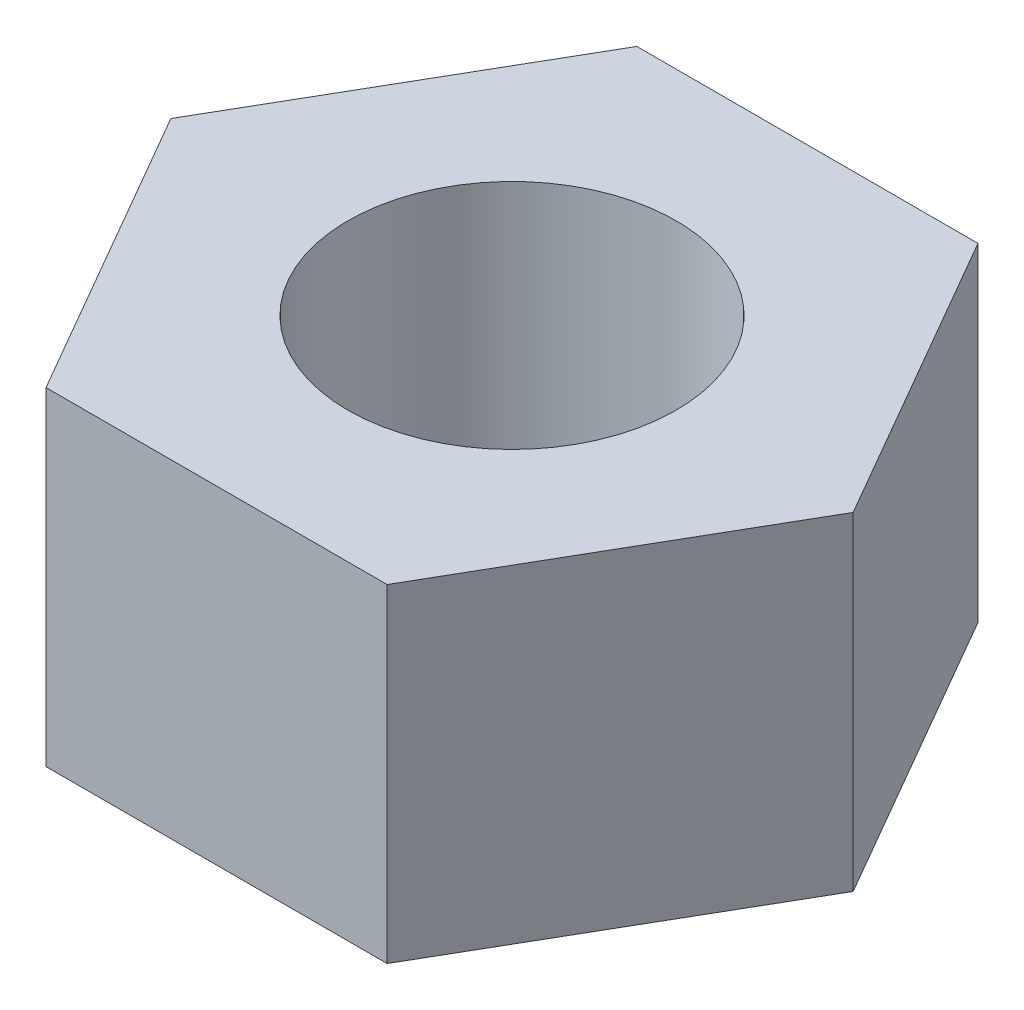
ISO-10303-21;
HEADER;
FILE_DESCRIPTION(('STEP AP214'),'2;1');
FILE_NAME('part.step','',(''),(''),'','','');
FILE_SCHEMA(('AUTOMOTIVE_DESIGN { 1 0 10303 214 1 1 1 1 }'));
ENDSEC;
DATA;
#1=APPLICATION_CONTEXT('core data for automotive mechanical design processes');
#2=APPLICATION_PROTOCOL_DEFINITION('international standard','automotive_design',2000,#1);
#3=PRODUCT_CONTEXT('',#1,'mechanical');
#4=PRODUCT('Part','Part','',(#3));
#5=PRODUCT_RELATED_PRODUCT_CATEGORY('part','',(#4));
#6=PRODUCT_DEFINITION_FORMATION('','',#4);
#7=PRODUCT_DEFINITION_CONTEXT('part definition',#1,'design');
#8=PRODUCT_DEFINITION('design','',#6,#7);
#9=PRODUCT_DEFINITION_SHAPE('','',#8);
#10=(LENGTH_UNIT() NAMED_UNIT(*) SI_UNIT(.MILLI.,.METRE.));
#11=(NAMED_UNIT(*) PLANE_ANGLE_UNIT() SI_UNIT($,.RADIAN.));
#12=(NAMED_UNIT(*) SI_UNIT($,.STERADIAN.) SOLID_ANGLE_UNIT());
#13=UNCERTAINTY_MEASURE_WITH_UNIT(LENGTH_MEASURE(1.E-05),#10,'distance_accuracy_value','');
#14=(GEOMETRIC_REPRESENTATION_CONTEXT(3) GLOBAL_UNCERTAINTY_ASSIGNED_CONTEXT((#13)) GLOBAL_UNIT_ASSIGNED_CONTEXT((#10,
#11,#12)) REPRESENTATION_CONTEXT('',''));
#15=CARTESIAN_POINT('',(0.,0.,0.));
#16=DIRECTION('',(0.,0.,1.));
#17=DIRECTION('',(1.,0.,0.));
#18=AXIS2_PLACEMENT_3D('',#15,#16,#17);
#19=CARTESIAN_POINT('',(0.,9.,0.));
#20=DIRECTION('',(0.,1.,0.));
#21=DIRECTION('',(0.,0.,1.));
#22=AXIS2_PLACEMENT_3D('',#19,#20,#21);
#23=PLANE('',#22);
#24=DIRECTION('',(-0.5,0.,-0.866025403784439));
#25=VECTOR('',#24,1.);
#26=CARTESIAN_POINT('',(9.35307436087194,9.,0.));
#27=LINE('',#26,#25);
#28=CARTESIAN_POINT('',(9.35307436087194,9.,0.));
#29=VERTEX_POINT('',#28);
#30=CARTESIAN_POINT('',(4.67653718043597,9.,-8.1));
#31=VERTEX_POINT('',#30);
#32=EDGE_CURVE('E129',#29,#31,#27,.T.);
#33=ORIENTED_EDGE('',*,*,#32,.T.);
#34=DIRECTION('',(-1.,0.,0.));
#35=VECTOR('',#34,1.);
#36=CARTESIAN_POINT('',(4.67653718043597,9.,-8.1));
#37=LINE('',#36,#35);
#38=CARTESIAN_POINT('',(-4.67653718043597,9.,-8.1));
#39=VERTEX_POINT('',#38);
#40=EDGE_CURVE('E87',#31,#39,#37,.T.);
#41=ORIENTED_EDGE('',*,*,#40,.T.);
#42=DIRECTION('',(-0.5,0.,0.866025403784439));
#43=VECTOR('',#42,1.);
#44=CARTESIAN_POINT('',(-4.67653718043597,9.,-8.1));
#45=LINE('',#44,#43);
#46=CARTESIAN_POINT('',(-9.35307436087193,9.,0.));
#47=VERTEX_POINT('',#46);
#48=EDGE_CURVE('E100',#39,#47,#45,.T.);
#49=ORIENTED_EDGE('',*,*,#48,.T.);
#50=DIRECTION('',(0.5,0.,0.866025403784439));
#51=VECTOR('',#50,1.);
#52=CARTESIAN_POINT('',(-9.35307436087193,9.,0.));
#53=LINE('',#52,#51);
#54=CARTESIAN_POINT('',(-4.67653718043596,9.,8.1));
#55=VERTEX_POINT('',#54);
#56=EDGE_CURVE('E94',#47,#55,#53,.T.);
#57=ORIENTED_EDGE('',*,*,#56,.T.);
#58=DIRECTION('',(1.,0.,0.));
#59=VECTOR('',#58,1.);
#60=CARTESIAN_POINT('',(-4.67653718043596,9.,8.1));
#61=LINE('',#60,#59);
#62=CARTESIAN_POINT('',(4.67653718043597,9.,8.1));
#63=VERTEX_POINT('',#62);
#64=EDGE_CURVE('E98',#55,#63,#61,.T.);
#65=ORIENTED_EDGE('',*,*,#64,.T.);
#66=DIRECTION('',(0.5,0.,-0.866025403784439));
#67=VECTOR('',#66,1.);
#68=CARTESIAN_POINT('',(4.67653718043597,9.,8.1));
#69=LINE('',#68,#67);
#70=EDGE_CURVE('E50',#63,#29,#69,.T.);
#71=ORIENTED_EDGE('',*,*,#70,.T.);
#72=EDGE_LOOP('',(#33,#41,#49,#57,#65,#71));
#73=FACE_BOUND('',#72,.T.);
#74=CARTESIAN_POINT('',(0.,9.,0.));
#75=DIRECTION('',(0.,1.,0.));
#76=DIRECTION('',(0.,0.,1.));
#77=AXIS2_PLACEMENT_3D('',#74,#75,#76);
#78=CIRCLE('',#77,4.5);
#79=CARTESIAN_POINT('',(0.,9.,4.5));
#80=VERTEX_POINT('',#79);
#81=EDGE_CURVE('E122',#80,#80,#78,.T.);
#82=ORIENTED_EDGE('',*,*,#81,.F.);
#83=EDGE_LOOP('',(#82));
#84=FACE_BOUND('',#83,.T.);
#85=ADVANCED_FACE('F33',(#73,#84),#23,.T.);
#86=CARTESIAN_POINT('',(0.,0.,0.));
#87=DIRECTION('',(0.,1.,0.));
#88=DIRECTION('',(0.,0.,1.));
#89=AXIS2_PLACEMENT_3D('',#86,#87,#88);
#90=PLANE('',#89);
#91=DIRECTION('',(-0.5,0.,-0.866025403784439));
#92=VECTOR('',#91,1.);
#93=CARTESIAN_POINT('',(9.35307436087194,0.,0.));
#94=LINE('',#93,#92);
#95=CARTESIAN_POINT('',(9.35307436087194,0.,0.));
#96=VERTEX_POINT('',#95);
#97=CARTESIAN_POINT('',(4.67653718043597,0.,-8.1));
#98=VERTEX_POINT('',#97);
#99=EDGE_CURVE('E118',#96,#98,#94,.T.);
#100=ORIENTED_EDGE('',*,*,#99,.F.);
#101=DIRECTION('',(0.5,0.,-0.866025403784439));
#102=VECTOR('',#101,1.);
#103=CARTESIAN_POINT('',(4.67653718043597,0.,8.1));
#104=LINE('',#103,#102);
#105=CARTESIAN_POINT('',(4.67653718043597,0.,8.1));
#106=VERTEX_POINT('',#105);
#107=EDGE_CURVE('E79',#106,#96,#104,.T.);
#108=ORIENTED_EDGE('',*,*,#107,.F.);
#109=DIRECTION('',(1.,0.,0.));
#110=VECTOR('',#109,1.);
#111=CARTESIAN_POINT('',(-4.67653718043596,0.,8.1));
#112=LINE('',#111,#110);
#113=CARTESIAN_POINT('',(-4.67653718043596,0.,8.1));
#114=VERTEX_POINT('',#113);
#115=EDGE_CURVE('E73',#114,#106,#112,.T.);
#116=ORIENTED_EDGE('',*,*,#115,.F.);
#117=DIRECTION('',(0.5,0.,0.866025403784439));
#118=VECTOR('',#117,1.);
#119=CARTESIAN_POINT('',(-9.35307436087193,0.,0.));
#120=LINE('',#119,#118);
#121=CARTESIAN_POINT('',(-9.35307436087193,0.,0.));
#122=VERTEX_POINT('',#121);
#123=EDGE_CURVE('E108',#122,#114,#120,.T.);
#124=ORIENTED_EDGE('',*,*,#123,.F.);
#125=DIRECTION('',(-0.5,0.,0.866025403784439));
#126=VECTOR('',#125,1.);
#127=CARTESIAN_POINT('',(-4.67653718043597,0.,-8.1));
#128=LINE('',#127,#126);
#129=CARTESIAN_POINT('',(-4.67653718043597,0.,-8.1));
#130=VERTEX_POINT('',#129);
#131=EDGE_CURVE('E124',#130,#122,#128,.T.);
#132=ORIENTED_EDGE('',*,*,#131,.F.);
#133=DIRECTION('',(-1.,0.,0.));
#134=VECTOR('',#133,1.);
#135=CARTESIAN_POINT('',(4.67653718043597,0.,-8.1));
#136=LINE('',#135,#134);
#137=EDGE_CURVE('E121',#98,#130,#136,.T.);
#138=ORIENTED_EDGE('',*,*,#137,.F.);
#139=EDGE_LOOP('',(#100,#108,#116,#124,#132,#138));
#140=FACE_BOUND('',#139,.T.);
#141=CARTESIAN_POINT('',(0.,0.,0.));
#142=DIRECTION('',(0.,1.,0.));
#143=DIRECTION('',(0.,0.,1.));
#144=AXIS2_PLACEMENT_3D('',#141,#142,#143);
#145=CIRCLE('',#144,4.5);
#146=CARTESIAN_POINT('',(0.,0.,4.5));
#147=VERTEX_POINT('',#146);
#148=EDGE_CURVE('E222',#147,#147,#145,.T.);
#149=ORIENTED_EDGE('',*,*,#148,.T.);
#150=EDGE_LOOP('',(#149));
#151=FACE_BOUND('',#150,.T.);
#152=ADVANCED_FACE('F138',(#140,#151),#90,.F.);
#153=CARTESIAN_POINT('',(9.35307436087194,9.,0.));
#154=DIRECTION('',(-0.866025403784439,0.,0.5));
#155=DIRECTION('',(0.5,0.,0.866025403784439));
#156=AXIS2_PLACEMENT_3D('',#153,#154,#155);
#157=PLANE('',#156);
#158=ORIENTED_EDGE('',*,*,#99,.T.);
#159=DIRECTION('',(0.,-1.,0.));
#160=VECTOR('',#159,1.);
#161=CARTESIAN_POINT('',(4.67653718043597,9.,-8.1));
#162=LINE('',#161,#160);
#163=EDGE_CURVE('E11',#31,#98,#162,.T.);
#164=ORIENTED_EDGE('',*,*,#163,.F.);
#165=ORIENTED_EDGE('',*,*,#32,.F.);
#166=DIRECTION('',(0.,-1.,0.));
#167=VECTOR('',#166,1.);
#168=CARTESIAN_POINT('',(9.35307436087194,9.,0.));
#169=LINE('',#168,#167);
#170=EDGE_CURVE('E114',#29,#96,#169,.T.);
#171=ORIENTED_EDGE('',*,*,#170,.T.);
#172=EDGE_LOOP('',(#158,#164,#165,#171));
#173=FACE_BOUND('',#172,.T.);
#174=ADVANCED_FACE('F35',(#173),#157,.F.);
#175=CARTESIAN_POINT('',(4.67653718043597,9.,-8.1));
#176=DIRECTION('',(0.,0.,1.));
#177=DIRECTION('',(1.,0.,0.));
#178=AXIS2_PLACEMENT_3D('',#175,#176,#177);
#179=PLANE('',#178);
#180=ORIENTED_EDGE('',*,*,#137,.T.);
#181=DIRECTION('',(0.,-1.,0.));
#182=VECTOR('',#181,1.);
#183=CARTESIAN_POINT('',(-4.67653718043597,9.,-8.1));
#184=LINE('',#183,#182);
#185=EDGE_CURVE('E42',#39,#130,#184,.T.);
#186=ORIENTED_EDGE('',*,*,#185,.F.);
#187=ORIENTED_EDGE('',*,*,#40,.F.);
#188=ORIENTED_EDGE('',*,*,#163,.T.);
#189=EDGE_LOOP('',(#180,#186,#187,#188));
#190=FACE_BOUND('',#189,.T.);
#191=ADVANCED_FACE('F163',(#190),#179,.F.);
#192=CARTESIAN_POINT('',(-4.67653718043597,9.,-8.1));
#193=DIRECTION('',(0.866025403784439,0.,0.5));
#194=DIRECTION('',(0.5,0.,-0.866025403784439));
#195=AXIS2_PLACEMENT_3D('',#192,#193,#194);
#196=PLANE('',#195);
#197=ORIENTED_EDGE('',*,*,#131,.T.);
#198=DIRECTION('',(0.,-1.,0.));
#199=VECTOR('',#198,1.);
#200=CARTESIAN_POINT('',(-9.35307436087193,9.,0.));
#201=LINE('',#200,#199);
#202=EDGE_CURVE('E109',#47,#122,#201,.T.);
#203=ORIENTED_EDGE('',*,*,#202,.F.);
#204=ORIENTED_EDGE('',*,*,#48,.F.);
#205=ORIENTED_EDGE('',*,*,#185,.T.);
#206=EDGE_LOOP('',(#197,#203,#204,#205));
#207=FACE_BOUND('',#206,.T.);
#208=ADVANCED_FACE('F135',(#207),#196,.F.);
#209=CARTESIAN_POINT('',(-9.35307436087193,9.,0.));
#210=DIRECTION('',(0.866025403784439,0.,-0.5));
#211=DIRECTION('',(-0.5,0.,-0.866025403784439));
#212=AXIS2_PLACEMENT_3D('',#209,#210,#211);
#213=PLANE('',#212);
#214=ORIENTED_EDGE('',*,*,#123,.T.);
#215=DIRECTION('',(0.,-1.,0.));
#216=VECTOR('',#215,1.);
#217=CARTESIAN_POINT('',(-4.67653718043596,9.,8.1));
#218=LINE('',#217,#216);
#219=EDGE_CURVE('E105',#55,#114,#218,.T.);
#220=ORIENTED_EDGE('',*,*,#219,.F.);
#221=ORIENTED_EDGE('',*,*,#56,.F.);
#222=ORIENTED_EDGE('',*,*,#202,.T.);
#223=EDGE_LOOP('',(#214,#220,#221,#222));
#224=FACE_BOUND('',#223,.T.);
#225=ADVANCED_FACE('F106',(#224),#213,.F.);
#226=CARTESIAN_POINT('',(-4.67653718043596,9.,8.1));
#227=DIRECTION('',(0.,0.,-1.));
#228=DIRECTION('',(-1.,0.,0.));
#229=AXIS2_PLACEMENT_3D('',#226,#227,#228);
#230=PLANE('',#229);
#231=ORIENTED_EDGE('',*,*,#115,.T.);
#232=DIRECTION('',(0.,-1.,0.));
#233=VECTOR('',#232,1.);
#234=CARTESIAN_POINT('',(4.67653718043597,9.,8.1));
#235=LINE('',#234,#233);
#236=EDGE_CURVE('E110',#63,#106,#235,.T.);
#237=ORIENTED_EDGE('',*,*,#236,.F.);
#238=ORIENTED_EDGE('',*,*,#64,.F.);
#239=ORIENTED_EDGE('',*,*,#219,.T.);
#240=EDGE_LOOP('',(#231,#237,#238,#239));
#241=FACE_BOUND('',#240,.T.);
#242=ADVANCED_FACE('F112',(#241),#230,.F.);
#243=CARTESIAN_POINT('',(4.67653718043597,9.,8.1));
#244=DIRECTION('',(-0.866025403784439,0.,-0.5));
#245=DIRECTION('',(-0.5,0.,0.866025403784439));
#246=AXIS2_PLACEMENT_3D('',#243,#244,#245);
#247=PLANE('',#246);
#248=ORIENTED_EDGE('',*,*,#107,.T.);
#249=ORIENTED_EDGE('',*,*,#170,.F.);
#250=ORIENTED_EDGE('',*,*,#70,.F.);
#251=ORIENTED_EDGE('',*,*,#236,.T.);
#252=EDGE_LOOP('',(#248,#249,#250,#251));
#253=FACE_BOUND('',#252,.T.);
#254=ADVANCED_FACE('F143',(#253),#247,.F.);
#255=CARTESIAN_POINT('',(0.,9.,0.));
#256=DIRECTION('',(0.,-1.,0.));
#257=DIRECTION('',(0.,0.,-1.));
#258=AXIS2_PLACEMENT_3D('',#255,#256,#257);
#259=CYLINDRICAL_SURFACE('',#258,4.5);
#260=ORIENTED_EDGE('',*,*,#81,.T.);
#261=EDGE_LOOP('',(#260));
#262=FACE_BOUND('',#261,.T.);
#263=ORIENTED_EDGE('',*,*,#148,.F.);
#264=EDGE_LOOP('',(#263));
#265=FACE_BOUND('',#264,.T.);
#266=ADVANCED_FACE('F145',(#262,#265),#259,.F.);
#267=CLOSED_SHELL('',(#85,#152,#174,#191,#208,#225,#242,#254,#266));
#268=MANIFOLD_SOLID_BREP('B2',#267);
#269=ADVANCED_BREP_SHAPE_REPRESENTATION('',(#18,#268),#14);
#270=SHAPE_DEFINITION_REPRESENTATION(#9,#269);
ENDSEC;
END-ISO-10303-21;
